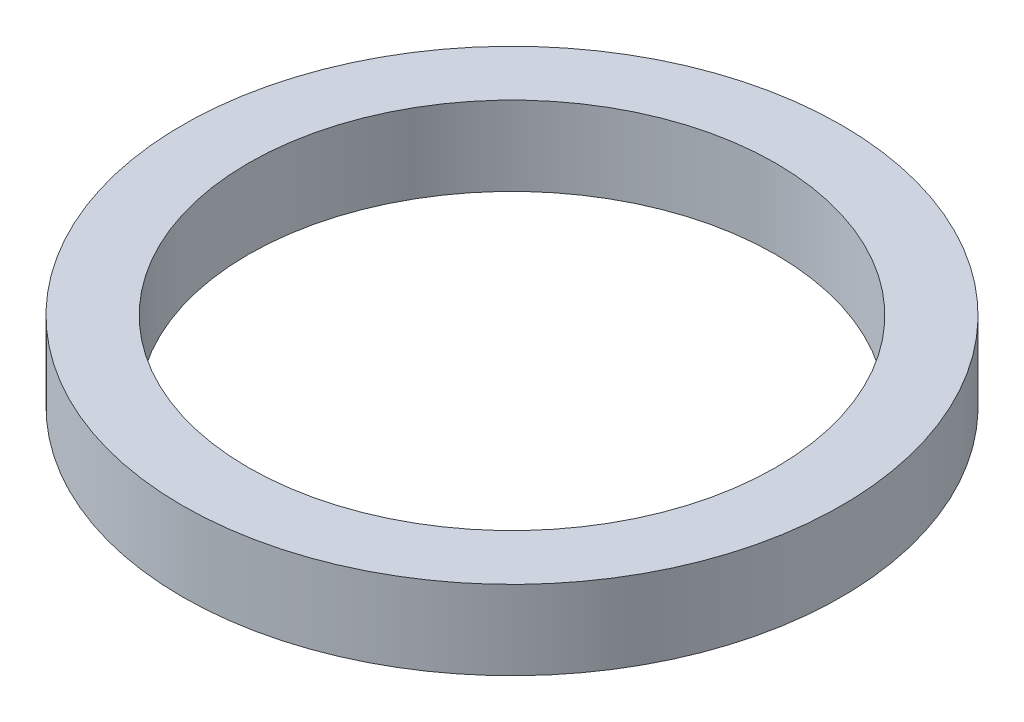
ISO-10303-21;
HEADER;
FILE_DESCRIPTION(('STEP AP214'),'2;1');
FILE_NAME('part.step','',(''),(''),'','','');
FILE_SCHEMA(('AUTOMOTIVE_DESIGN { 1 0 10303 214 1 1 1 1 }'));
ENDSEC;
DATA;
#1=APPLICATION_CONTEXT('core data for automotive mechanical design processes');
#2=APPLICATION_PROTOCOL_DEFINITION('international standard','automotive_design',2000,#1);
#3=PRODUCT_CONTEXT('',#1,'mechanical');
#4=PRODUCT('Part','Part','',(#3));
#5=PRODUCT_RELATED_PRODUCT_CATEGORY('part','',(#4));
#6=PRODUCT_DEFINITION_FORMATION('','',#4);
#7=PRODUCT_DEFINITION_CONTEXT('part definition',#1,'design');
#8=PRODUCT_DEFINITION('design','',#6,#7);
#9=PRODUCT_DEFINITION_SHAPE('','',#8);
#10=(LENGTH_UNIT() NAMED_UNIT(*) SI_UNIT(.MILLI.,.METRE.));
#11=(NAMED_UNIT(*) PLANE_ANGLE_UNIT() SI_UNIT($,.RADIAN.));
#12=(NAMED_UNIT(*) SI_UNIT($,.STERADIAN.) SOLID_ANGLE_UNIT());
#13=UNCERTAINTY_MEASURE_WITH_UNIT(LENGTH_MEASURE(1.E-05),#10,'distance_accuracy_value','');
#14=(GEOMETRIC_REPRESENTATION_CONTEXT(3) GLOBAL_UNCERTAINTY_ASSIGNED_CONTEXT((#13)) GLOBAL_UNIT_ASSIGNED_CONTEXT((#10,
#11,#12)) REPRESENTATION_CONTEXT('',''));
#15=CARTESIAN_POINT('',(0.,0.,0.));
#16=DIRECTION('',(0.,0.,1.));
#17=DIRECTION('',(1.,0.,0.));
#18=AXIS2_PLACEMENT_3D('',#15,#16,#17);
#19=CARTESIAN_POINT('',(0.,6.,0.));
#20=DIRECTION('',(0.,1.,0.));
#21=DIRECTION('',(0.,0.,1.));
#22=AXIS2_PLACEMENT_3D('',#19,#20,#21);
#23=PLANE('',#22);
#24=CARTESIAN_POINT('',(0.,6.,0.));
#25=DIRECTION('',(0.,1.,0.));
#26=DIRECTION('',(0.,0.,1.));
#27=AXIS2_PLACEMENT_3D('',#24,#25,#26);
#28=CIRCLE('',#27,25.);
#29=CARTESIAN_POINT('',(0.,6.,25.));
#30=VERTEX_POINT('',#29);
#31=EDGE_CURVE('E10',#30,#30,#28,.T.);
#32=ORIENTED_EDGE('',*,*,#31,.T.);
#33=EDGE_LOOP('',(#32));
#34=FACE_BOUND('',#33,.T.);
#35=CARTESIAN_POINT('',(0.,6.,0.));
#36=DIRECTION('',(0.,1.,0.));
#37=DIRECTION('',(0.,0.,1.));
#38=AXIS2_PLACEMENT_3D('',#35,#36,#37);
#39=CIRCLE('',#38,20.);
#40=CARTESIAN_POINT('',(0.,6.,20.));
#41=VERTEX_POINT('',#40);
#42=EDGE_CURVE('E46',#41,#41,#39,.T.);
#43=ORIENTED_EDGE('',*,*,#42,.F.);
#44=EDGE_LOOP('',(#43));
#45=FACE_BOUND('',#44,.T.);
#46=ADVANCED_FACE('F35',(#34,#45),#23,.T.);
#47=CARTESIAN_POINT('',(0.,0.,0.));
#48=DIRECTION('',(0.,1.,0.));
#49=DIRECTION('',(0.,0.,1.));
#50=AXIS2_PLACEMENT_3D('',#47,#48,#49);
#51=PLANE('',#50);
#52=CARTESIAN_POINT('',(0.,0.,0.));
#53=DIRECTION('',(0.,1.,0.));
#54=DIRECTION('',(0.,0.,1.));
#55=AXIS2_PLACEMENT_3D('',#52,#53,#54);
#56=CIRCLE('',#55,25.);
#57=CARTESIAN_POINT('',(0.,0.,25.));
#58=VERTEX_POINT('',#57);
#59=EDGE_CURVE('E39',#58,#58,#56,.T.);
#60=ORIENTED_EDGE('',*,*,#59,.F.);
#61=EDGE_LOOP('',(#60));
#62=FACE_BOUND('',#61,.T.);
#63=CARTESIAN_POINT('',(0.,0.,0.));
#64=DIRECTION('',(0.,1.,0.));
#65=DIRECTION('',(0.,0.,1.));
#66=AXIS2_PLACEMENT_3D('',#63,#64,#65);
#67=CIRCLE('',#66,20.);
#68=CARTESIAN_POINT('',(0.,0.,20.));
#69=VERTEX_POINT('',#68);
#70=EDGE_CURVE('E48',#69,#69,#67,.T.);
#71=ORIENTED_EDGE('',*,*,#70,.T.);
#72=EDGE_LOOP('',(#71));
#73=FACE_BOUND('',#72,.T.);
#74=ADVANCED_FACE('F58',(#62,#73),#51,.F.);
#75=CARTESIAN_POINT('',(0.,6.,0.));
#76=DIRECTION('',(0.,-1.,0.));
#77=DIRECTION('',(0.,0.,-1.));
#78=AXIS2_PLACEMENT_3D('',#75,#76,#77);
#79=CYLINDRICAL_SURFACE('',#78,25.);
#80=ORIENTED_EDGE('',*,*,#31,.F.);
#81=EDGE_LOOP('',(#80));
#82=FACE_BOUND('',#81,.T.);
#83=ORIENTED_EDGE('',*,*,#59,.T.);
#84=EDGE_LOOP('',(#83));
#85=FACE_BOUND('',#84,.T.);
#86=ADVANCED_FACE('F37',(#82,#85),#79,.T.);
#87=CARTESIAN_POINT('',(0.,6.,0.));
#88=DIRECTION('',(0.,-1.,0.));
#89=DIRECTION('',(0.,0.,-1.));
#90=AXIS2_PLACEMENT_3D('',#87,#88,#89);
#91=CYLINDRICAL_SURFACE('',#90,20.);
#92=ORIENTED_EDGE('',*,*,#42,.T.);
#93=EDGE_LOOP('',(#92));
#94=FACE_BOUND('',#93,.T.);
#95=ORIENTED_EDGE('',*,*,#70,.F.);
#96=EDGE_LOOP('',(#95));
#97=FACE_BOUND('',#96,.T.);
#98=ADVANCED_FACE('F54',(#94,#97),#91,.F.);
#99=CLOSED_SHELL('',(#46,#74,#86,#98));
#100=MANIFOLD_SOLID_BREP('B2',#99);
#101=ADVANCED_BREP_SHAPE_REPRESENTATION('',(#18,#100),#14);
#102=SHAPE_DEFINITION_REPRESENTATION(#9,#101);
ENDSEC;
END-ISO-10303-21;
